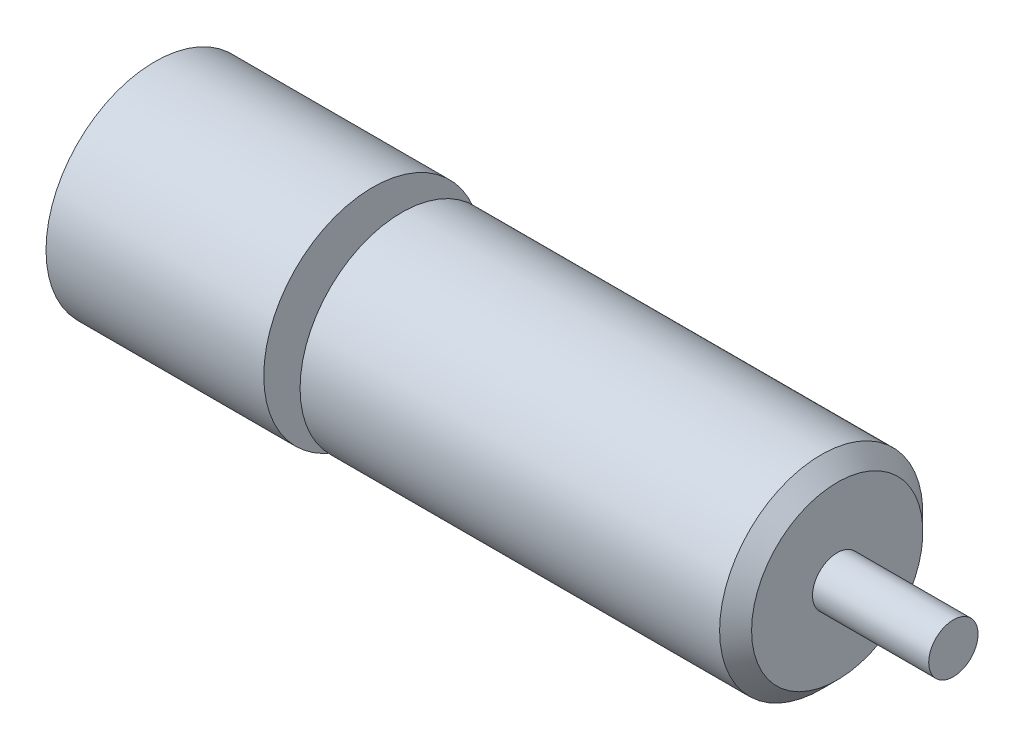
ISO-10303-21;
HEADER;
FILE_DESCRIPTION(('STEP AP214'),'2;1');
FILE_NAME('part.step','',(''),(''),'','','');
FILE_SCHEMA(('AUTOMOTIVE_DESIGN { 1 0 10303 214 1 1 1 1 }'));
ENDSEC;
DATA;
#1=APPLICATION_CONTEXT('core data for automotive mechanical design processes');
#2=APPLICATION_PROTOCOL_DEFINITION('international standard','automotive_design',2000,#1);
#3=PRODUCT_CONTEXT('',#1,'mechanical');
#4=PRODUCT('Part','Part','',(#3));
#5=PRODUCT_RELATED_PRODUCT_CATEGORY('part','',(#4));
#6=PRODUCT_DEFINITION_FORMATION('','',#4);
#7=PRODUCT_DEFINITION_CONTEXT('part definition',#1,'design');
#8=PRODUCT_DEFINITION('design','',#6,#7);
#9=PRODUCT_DEFINITION_SHAPE('','',#8);
#10=(LENGTH_UNIT() NAMED_UNIT(*) SI_UNIT(.MILLI.,.METRE.));
#11=(NAMED_UNIT(*) PLANE_ANGLE_UNIT() SI_UNIT($,.RADIAN.));
#12=(NAMED_UNIT(*) SI_UNIT($,.STERADIAN.) SOLID_ANGLE_UNIT());
#13=UNCERTAINTY_MEASURE_WITH_UNIT(LENGTH_MEASURE(1.E-05),#10,'distance_accuracy_value','');
#14=(GEOMETRIC_REPRESENTATION_CONTEXT(3) GLOBAL_UNCERTAINTY_ASSIGNED_CONTEXT((#13)) GLOBAL_UNIT_ASSIGNED_CONTEXT((#10,
#11,#12)) REPRESENTATION_CONTEXT('',''));
#15=CARTESIAN_POINT('',(0.,0.,0.));
#16=DIRECTION('',(0.,0.,1.));
#17=DIRECTION('',(1.,0.,0.));
#18=AXIS2_PLACEMENT_3D('',#15,#16,#17);
#19=CARTESIAN_POINT('',(0.,0.,0.));
#20=DIRECTION('',(1.,0.,0.));
#21=DIRECTION('',(0.,0.,-1.));
#22=AXIS2_PLACEMENT_3D('',#19,#20,#21);
#23=PLANE('',#22);
#24=CARTESIAN_POINT('',(0.,0.,0.));
#25=DIRECTION('',(-1.,0.,0.));
#26=DIRECTION('',(0.,0.,1.));
#27=AXIS2_PLACEMENT_3D('',#24,#25,#26);
#28=CIRCLE('',#27,7.5);
#29=CARTESIAN_POINT('',(0.,0.,7.5));
#30=VERTEX_POINT('',#29);
#31=EDGE_CURVE('E10',#30,#30,#28,.T.);
#32=ORIENTED_EDGE('',*,*,#31,.T.);
#33=EDGE_LOOP('',(#32));
#34=FACE_BOUND('',#33,.T.);
#35=ADVANCED_FACE('F37',(#34),#23,.F.);
#36=CARTESIAN_POINT('',(-20.4007602273155,0.,0.));
#37=DIRECTION('',(-1.,0.,0.));
#38=DIRECTION('',(0.,0.,1.));
#39=AXIS2_PLACEMENT_3D('',#36,#37,#38);
#40=CYLINDRICAL_SURFACE('',#39,7.5);
#41=ORIENTED_EDGE('',*,*,#31,.F.);
#42=EDGE_LOOP('',(#41));
#43=FACE_BOUND('',#42,.T.);
#44=CARTESIAN_POINT('',(15.,0.,0.));
#45=DIRECTION('',(-1.,0.,0.));
#46=DIRECTION('',(0.,0.,1.));
#47=AXIS2_PLACEMENT_3D('',#44,#45,#46);
#48=CIRCLE('',#47,7.5);
#49=CARTESIAN_POINT('',(15.,0.,7.5));
#50=VERTEX_POINT('',#49);
#51=EDGE_CURVE('E43',#50,#50,#48,.T.);
#52=ORIENTED_EDGE('',*,*,#51,.T.);
#53=EDGE_LOOP('',(#52));
#54=FACE_BOUND('',#53,.T.);
#55=ADVANCED_FACE('F93',(#43,#54),#40,.T.);
#56=CARTESIAN_POINT('',(15.,7.5,0.));
#57=DIRECTION('',(-1.,0.,0.));
#58=DIRECTION('',(0.,0.,1.));
#59=AXIS2_PLACEMENT_3D('',#56,#57,#58);
#60=PLANE('',#59);
#61=ORIENTED_EDGE('',*,*,#51,.F.);
#62=EDGE_LOOP('',(#61));
#63=FACE_BOUND('',#62,.T.);
#64=CARTESIAN_POINT('',(15.,0.,0.));
#65=DIRECTION('',(-1.,0.,0.));
#66=DIRECTION('',(0.,0.,1.));
#67=AXIS2_PLACEMENT_3D('',#64,#65,#66);
#68=CIRCLE('',#67,3.75);
#69=CARTESIAN_POINT('',(15.,0.,3.75));
#70=VERTEX_POINT('',#69);
#71=EDGE_CURVE('E47',#70,#70,#68,.T.);
#72=ORIENTED_EDGE('',*,*,#71,.T.);
#73=EDGE_LOOP('',(#72));
#74=FACE_BOUND('',#73,.T.);
#75=ADVANCED_FACE('F97',(#63,#74),#60,.F.);
#76=CARTESIAN_POINT('',(-20.4007602273155,0.,0.));
#77=DIRECTION('',(-1.,0.,0.));
#78=DIRECTION('',(0.,0.,1.));
#79=AXIS2_PLACEMENT_3D('',#76,#77,#78);
#80=CYLINDRICAL_SURFACE('',#79,3.75);
#81=ORIENTED_EDGE('',*,*,#71,.F.);
#82=EDGE_LOOP('',(#81));
#83=FACE_BOUND('',#82,.T.);
#84=CARTESIAN_POINT('',(17.,0.,0.));
#85=DIRECTION('',(-1.,0.,0.));
#86=DIRECTION('',(0.,0.,1.));
#87=AXIS2_PLACEMENT_3D('',#84,#85,#86);
#88=CIRCLE('',#87,3.75);
#89=CARTESIAN_POINT('',(17.,0.,3.75));
#90=VERTEX_POINT('',#89);
#91=EDGE_CURVE('E51',#90,#90,#88,.T.);
#92=ORIENTED_EDGE('',*,*,#91,.T.);
#93=EDGE_LOOP('',(#92));
#94=FACE_BOUND('',#93,.T.);
#95=ADVANCED_FACE('F102',(#83,#94),#80,.T.);
#96=CARTESIAN_POINT('',(17.,3.75,0.));
#97=DIRECTION('',(1.,0.,0.));
#98=DIRECTION('',(0.,0.,-1.));
#99=AXIS2_PLACEMENT_3D('',#96,#97,#98);
#100=PLANE('',#99);
#101=CARTESIAN_POINT('',(17.,0.,0.));
#102=DIRECTION('',(-1.,0.,0.));
#103=DIRECTION('',(0.,0.,1.));
#104=AXIS2_PLACEMENT_3D('',#101,#102,#103);
#105=CIRCLE('',#104,7.);
#106=CARTESIAN_POINT('',(17.,0.,7.));
#107=VERTEX_POINT('',#106);
#108=EDGE_CURVE('E62',#107,#107,#105,.T.);
#109=ORIENTED_EDGE('',*,*,#108,.T.);
#110=EDGE_LOOP('',(#109));
#111=FACE_BOUND('',#110,.T.);
#112=ORIENTED_EDGE('',*,*,#91,.F.);
#113=EDGE_LOOP('',(#112));
#114=FACE_BOUND('',#113,.T.);
#115=ADVANCED_FACE('F107',(#111,#114),#100,.F.);
#116=CARTESIAN_POINT('',(47.,0.,0.));
#117=DIRECTION('',(-1.,0.,0.));
#118=DIRECTION('',(0.,0.,1.));
#119=AXIS2_PLACEMENT_3D('',#116,#117,#118);
#120=CYLINDRICAL_SURFACE('',#119,7.);
#121=ORIENTED_EDGE('',*,*,#108,.F.);
#122=EDGE_LOOP('',(#121));
#123=FACE_BOUND('',#122,.T.);
#124=CARTESIAN_POINT('',(45.8985,0.,0.));
#125=DIRECTION('',(-1.,0.,0.));
#126=DIRECTION('',(0.,0.,1.));
#127=AXIS2_PLACEMENT_3D('',#124,#125,#126);
#128=CIRCLE('',#127,7.);
#129=CARTESIAN_POINT('',(45.8985,0.,7.));
#130=VERTEX_POINT('',#129);
#131=EDGE_CURVE('E68',#130,#130,#128,.T.);
#132=ORIENTED_EDGE('',*,*,#131,.T.);
#133=EDGE_LOOP('',(#132));
#134=FACE_BOUND('',#133,.T.);
#135=ADVANCED_FACE('F72',(#123,#134),#120,.T.);
#136=CARTESIAN_POINT('',(47.,0.,0.));
#137=DIRECTION('',(-1.,0.,0.));
#138=DIRECTION('',(0.,0.,1.));
#139=AXIS2_PLACEMENT_3D('',#136,#137,#138);
#140=CONICAL_SURFACE('',#139,5.8985,0.785398163397455);
#141=ORIENTED_EDGE('',*,*,#131,.F.);
#142=EDGE_LOOP('',(#141));
#143=FACE_BOUND('',#142,.T.);
#144=CARTESIAN_POINT('',(47.,0.,0.));
#145=DIRECTION('',(-1.,0.,0.));
#146=DIRECTION('',(0.,0.,1.));
#147=AXIS2_PLACEMENT_3D('',#144,#145,#146);
#148=CIRCLE('',#147,5.8985);
#149=CARTESIAN_POINT('',(47.,0.,5.8985));
#150=VERTEX_POINT('',#149);
#151=EDGE_CURVE('E65',#150,#150,#148,.T.);
#152=ORIENTED_EDGE('',*,*,#151,.T.);
#153=EDGE_LOOP('',(#152));
#154=FACE_BOUND('',#153,.T.);
#155=ADVANCED_FACE('F74',(#143,#154),#140,.T.);
#156=CARTESIAN_POINT('',(55.,1.7,0.));
#157=DIRECTION('',(-1.,0.,0.));
#158=DIRECTION('',(0.,0.,1.));
#159=AXIS2_PLACEMENT_3D('',#156,#157,#158);
#160=PLANE('',#159);
#161=CARTESIAN_POINT('',(55.,0.,0.));
#162=DIRECTION('',(-1.,0.,0.));
#163=DIRECTION('',(0.,0.,1.));
#164=AXIS2_PLACEMENT_3D('',#161,#162,#163);
#165=CIRCLE('',#164,1.7);
#166=CARTESIAN_POINT('',(55.,0.,1.7));
#167=VERTEX_POINT('',#166);
#168=EDGE_CURVE('E59',#167,#167,#165,.T.);
#169=ORIENTED_EDGE('',*,*,#168,.F.);
#170=EDGE_LOOP('',(#169));
#171=FACE_BOUND('',#170,.T.);
#172=ADVANCED_FACE('F77',(#171),#160,.F.);
#173=CARTESIAN_POINT('',(-20.4007602273155,0.,0.));
#174=DIRECTION('',(-1.,0.,0.));
#175=DIRECTION('',(0.,0.,1.));
#176=AXIS2_PLACEMENT_3D('',#173,#174,#175);
#177=CYLINDRICAL_SURFACE('',#176,1.7);
#178=CARTESIAN_POINT('',(47.,0.,0.));
#179=DIRECTION('',(-1.,0.,0.));
#180=DIRECTION('',(0.,0.,1.));
#181=AXIS2_PLACEMENT_3D('',#178,#179,#180);
#182=CIRCLE('',#181,1.7);
#183=CARTESIAN_POINT('',(47.,0.,1.7));
#184=VERTEX_POINT('',#183);
#185=EDGE_CURVE('E56',#184,#184,#182,.T.);
#186=ORIENTED_EDGE('',*,*,#185,.F.);
#187=EDGE_LOOP('',(#186));
#188=FACE_BOUND('',#187,.T.);
#189=ORIENTED_EDGE('',*,*,#168,.T.);
#190=EDGE_LOOP('',(#189));
#191=FACE_BOUND('',#190,.T.);
#192=ADVANCED_FACE('F83',(#188,#191),#177,.T.);
#193=CARTESIAN_POINT('',(47.,7.5,0.));
#194=DIRECTION('',(-1.,0.,0.));
#195=DIRECTION('',(0.,0.,1.));
#196=AXIS2_PLACEMENT_3D('',#193,#194,#195);
#197=PLANE('',#196);
#198=ORIENTED_EDGE('',*,*,#185,.T.);
#199=EDGE_LOOP('',(#198));
#200=FACE_BOUND('',#199,.T.);
#201=ORIENTED_EDGE('',*,*,#151,.F.);
#202=EDGE_LOOP('',(#201));
#203=FACE_BOUND('',#202,.T.);
#204=ADVANCED_FACE('F81',(#200,#203),#197,.F.);
#205=CLOSED_SHELL('',(#35,#55,#75,#95,#115,#135,#155,#172,#192,#204));
#206=MANIFOLD_SOLID_BREP('B2',#205);
#207=ADVANCED_BREP_SHAPE_REPRESENTATION('',(#18,#206),#14);
#208=SHAPE_DEFINITION_REPRESENTATION(#9,#207);
ENDSEC;
END-ISO-10303-21;
